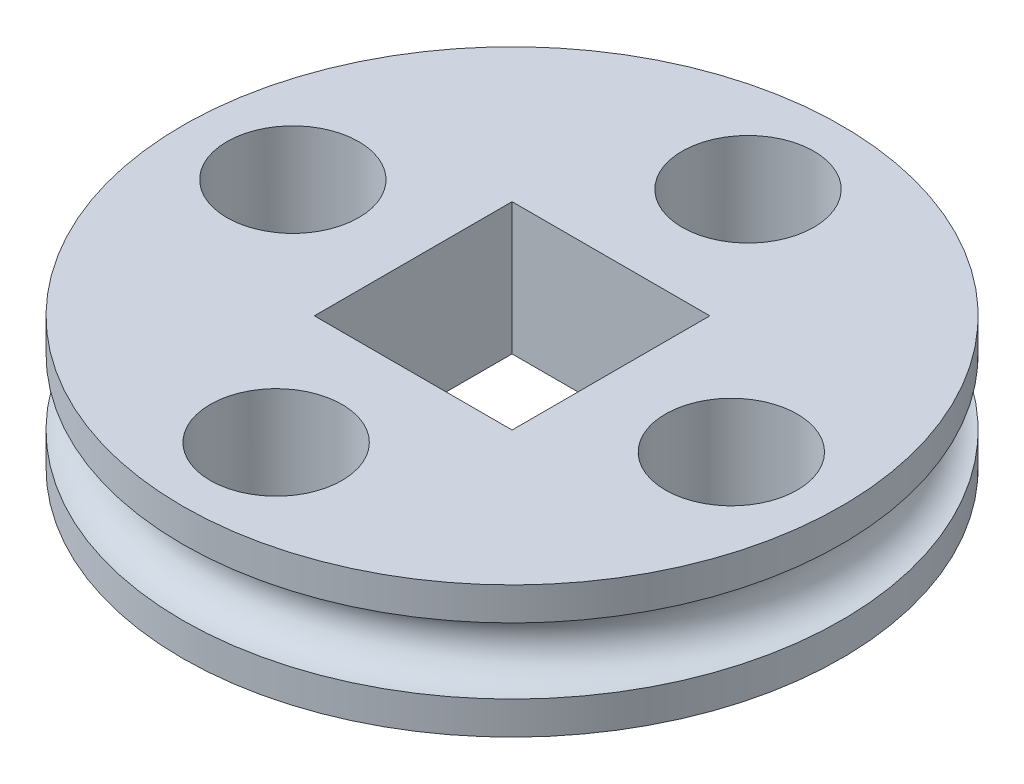
ISO-10303-21;
HEADER;
FILE_DESCRIPTION(('STEP AP214'),'2;1');
FILE_NAME('part.step','',(''),(''),'','','');
FILE_SCHEMA(('AUTOMOTIVE_DESIGN { 1 0 10303 214 1 1 1 1 }'));
ENDSEC;
DATA;
#1=APPLICATION_CONTEXT('core data for automotive mechanical design processes');
#2=APPLICATION_PROTOCOL_DEFINITION('international standard','automotive_design',2000,#1);
#3=PRODUCT_CONTEXT('',#1,'mechanical');
#4=PRODUCT('Part','Part','',(#3));
#5=PRODUCT_RELATED_PRODUCT_CATEGORY('part','',(#4));
#6=PRODUCT_DEFINITION_FORMATION('','',#4);
#7=PRODUCT_DEFINITION_CONTEXT('part definition',#1,'design');
#8=PRODUCT_DEFINITION('design','',#6,#7);
#9=PRODUCT_DEFINITION_SHAPE('','',#8);
#10=(LENGTH_UNIT() NAMED_UNIT(*) SI_UNIT(.MILLI.,.METRE.));
#11=(NAMED_UNIT(*) PLANE_ANGLE_UNIT() SI_UNIT($,.RADIAN.));
#12=(NAMED_UNIT(*) SI_UNIT($,.STERADIAN.) SOLID_ANGLE_UNIT());
#13=UNCERTAINTY_MEASURE_WITH_UNIT(LENGTH_MEASURE(1.E-05),#10,'distance_accuracy_value','');
#14=(GEOMETRIC_REPRESENTATION_CONTEXT(3) GLOBAL_UNCERTAINTY_ASSIGNED_CONTEXT((#13)) GLOBAL_UNIT_ASSIGNED_CONTEXT((#10,
#11,#12)) REPRESENTATION_CONTEXT('',''));
#15=CARTESIAN_POINT('',(0.,0.,0.));
#16=DIRECTION('',(0.,0.,1.));
#17=DIRECTION('',(1.,0.,0.));
#18=AXIS2_PLACEMENT_3D('',#15,#16,#17);
#19=CARTESIAN_POINT('',(0.,2.,0.));
#20=DIRECTION('',(0.,-1.,0.));
#21=DIRECTION('',(0.,0.,-1.));
#22=AXIS2_PLACEMENT_3D('',#19,#20,#21);
#23=CYLINDRICAL_SURFACE('',#22,5.);
#24=CARTESIAN_POINT('',(0.,1.5,0.));
#25=DIRECTION('',(0.,1.,0.));
#26=DIRECTION('',(0.,0.,1.));
#27=AXIS2_PLACEMENT_3D('',#24,#25,#26);
#28=CIRCLE('',#27,5.);
#29=CARTESIAN_POINT('',(0.,1.5,5.));
#30=VERTEX_POINT('',#29);
#31=EDGE_CURVE('E178',#30,#30,#28,.T.);
#32=ORIENTED_EDGE('',*,*,#31,.T.);
#33=EDGE_LOOP('',(#32));
#34=FACE_BOUND('',#33,.T.);
#35=CARTESIAN_POINT('',(0.,2.,0.));
#36=DIRECTION('',(0.,1.,0.));
#37=DIRECTION('',(0.,0.,1.));
#38=AXIS2_PLACEMENT_3D('',#35,#36,#37);
#39=CIRCLE('',#38,5.);
#40=CARTESIAN_POINT('',(0.,2.,5.));
#41=VERTEX_POINT('',#40);
#42=EDGE_CURVE('E123',#41,#41,#39,.T.);
#43=ORIENTED_EDGE('',*,*,#42,.F.);
#44=EDGE_LOOP('',(#43));
#45=FACE_BOUND('',#44,.T.);
#46=ADVANCED_FACE('F43',(#34,#45),#23,.T.);
#47=CARTESIAN_POINT('',(0.,0.5,0.));
#48=DIRECTION('',(0.,1.,0.));
#49=DIRECTION('',(0.,0.,1.));
#50=AXIS2_PLACEMENT_3D('',#47,#48,#49);
#51=CIRCLE('',#50,5.);
#52=CARTESIAN_POINT('',(0.,0.5,5.));
#53=VERTEX_POINT('',#52);
#54=EDGE_CURVE('E168',#53,#53,#51,.T.);
#55=ORIENTED_EDGE('',*,*,#54,.F.);
#56=EDGE_LOOP('',(#55));
#57=FACE_BOUND('',#56,.T.);
#58=CARTESIAN_POINT('',(0.,0.,0.));
#59=DIRECTION('',(0.,1.,0.));
#60=DIRECTION('',(0.,0.,1.));
#61=AXIS2_PLACEMENT_3D('',#58,#59,#60);
#62=CIRCLE('',#61,5.);
#63=CARTESIAN_POINT('',(0.,0.,5.));
#64=VERTEX_POINT('',#63);
#65=EDGE_CURVE('E118',#64,#64,#62,.T.);
#66=ORIENTED_EDGE('',*,*,#65,.T.);
#67=EDGE_LOOP('',(#66));
#68=FACE_BOUND('',#67,.T.);
#69=ADVANCED_FACE('F45',(#57,#68),#23,.T.);
#70=CARTESIAN_POINT('',(0.,2.,0.));
#71=DIRECTION('',(0.,1.,0.));
#72=DIRECTION('',(0.,0.,1.));
#73=AXIS2_PLACEMENT_3D('',#70,#71,#72);
#74=PLANE('',#73);
#75=CARTESIAN_POINT('',(-0.126446107978862,2.,3.45280992710836));
#76=DIRECTION('',(0.,1.,0.));
#77=DIRECTION('',(-1.,0.,0.));
#78=AXIS2_PLACEMENT_3D('',#75,#76,#77);
#79=CIRCLE('',#78,1.);
#80=CARTESIAN_POINT('',(-1.12644610797886,2.,3.45280992710836));
#81=VERTEX_POINT('',#80);
#82=EDGE_CURVE('E147',#81,#81,#79,.T.);
#83=ORIENTED_EDGE('',*,*,#82,.F.);
#84=EDGE_LOOP('',(#83));
#85=FACE_BOUND('',#84,.T.);
#86=CARTESIAN_POINT('',(-3.45280992710836,2.,-0.12644610797885));
#87=DIRECTION('',(0.,1.,0.));
#88=DIRECTION('',(0.,0.,-1.));
#89=AXIS2_PLACEMENT_3D('',#86,#87,#88);
#90=CIRCLE('',#89,1.);
#91=CARTESIAN_POINT('',(-3.45280992710836,2.,-1.12644610797885));
#92=VERTEX_POINT('',#91);
#93=EDGE_CURVE('E167',#92,#92,#90,.T.);
#94=ORIENTED_EDGE('',*,*,#93,.F.);
#95=EDGE_LOOP('',(#94));
#96=FACE_BOUND('',#95,.T.);
#97=CARTESIAN_POINT('',(0.126446107978887,2.,-3.45280992710836));
#98=DIRECTION('',(0.,1.,0.));
#99=DIRECTION('',(1.,0.,0.));
#100=AXIS2_PLACEMENT_3D('',#97,#98,#99);
#101=CIRCLE('',#100,1.);
#102=CARTESIAN_POINT('',(1.12644610797889,2.,-3.45280992710835));
#103=VERTEX_POINT('',#102);
#104=EDGE_CURVE('E162',#103,#103,#101,.T.);
#105=ORIENTED_EDGE('',*,*,#104,.F.);
#106=EDGE_LOOP('',(#105));
#107=FACE_BOUND('',#106,.T.);
#108=CARTESIAN_POINT('',(3.45280992710836,2.,0.12644610797885));
#109=DIRECTION('',(0.,1.,0.));
#110=DIRECTION('',(0.,0.,1.));
#111=AXIS2_PLACEMENT_3D('',#108,#109,#110);
#112=CIRCLE('',#111,1.);
#113=CARTESIAN_POINT('',(3.45280992710836,2.,1.12644610797885));
#114=VERTEX_POINT('',#113);
#115=EDGE_CURVE('E142',#114,#114,#112,.T.);
#116=ORIENTED_EDGE('',*,*,#115,.F.);
#117=EDGE_LOOP('',(#116));
#118=FACE_BOUND('',#117,.T.);
#119=DIRECTION('',(0.,0.,-1.));
#120=VECTOR('',#119,1.);
#121=CARTESIAN_POINT('',(1.5,2.,-1.5));
#122=LINE('',#121,#120);
#123=CARTESIAN_POINT('',(1.5,2.,1.5));
#124=VERTEX_POINT('',#123);
#125=CARTESIAN_POINT('',(1.5,2.,-1.5));
#126=VERTEX_POINT('',#125);
#127=EDGE_CURVE('E61',#124,#126,#122,.T.);
#128=ORIENTED_EDGE('',*,*,#127,.F.);
#129=DIRECTION('',(1.,0.,0.));
#130=VECTOR('',#129,1.);
#131=CARTESIAN_POINT('',(1.5,2.,1.5));
#132=LINE('',#131,#130);
#133=CARTESIAN_POINT('',(-1.5,2.,1.5));
#134=VERTEX_POINT('',#133);
#135=EDGE_CURVE('E108',#134,#124,#132,.T.);
#136=ORIENTED_EDGE('',*,*,#135,.F.);
#137=DIRECTION('',(0.,0.,1.));
#138=VECTOR('',#137,1.);
#139=CARTESIAN_POINT('',(-1.5,2.,-1.5));
#140=LINE('',#139,#138);
#141=CARTESIAN_POINT('',(-1.5,2.,-1.5));
#142=VERTEX_POINT('',#141);
#143=EDGE_CURVE('E90',#142,#134,#140,.T.);
#144=ORIENTED_EDGE('',*,*,#143,.F.);
#145=DIRECTION('',(-1.,0.,0.));
#146=VECTOR('',#145,1.);
#147=CARTESIAN_POINT('',(1.5,2.,-1.5));
#148=LINE('',#147,#146);
#149=EDGE_CURVE('E100',#126,#142,#148,.T.);
#150=ORIENTED_EDGE('',*,*,#149,.F.);
#151=EDGE_LOOP('',(#128,#136,#144,#150));
#152=FACE_BOUND('',#151,.T.);
#153=ORIENTED_EDGE('',*,*,#42,.T.);
#154=EDGE_LOOP('',(#153));
#155=FACE_BOUND('',#154,.T.);
#156=ADVANCED_FACE('F105',(#85,#96,#107,#118,#152,#155),#74,.T.);
#157=CARTESIAN_POINT('',(0.,0.,0.));
#158=DIRECTION('',(0.,1.,0.));
#159=DIRECTION('',(0.,0.,1.));
#160=AXIS2_PLACEMENT_3D('',#157,#158,#159);
#161=PLANE('',#160);
#162=CARTESIAN_POINT('',(-0.126446107978862,0.,3.45280992710836));
#163=DIRECTION('',(0.,1.,0.));
#164=DIRECTION('',(0.,0.,1.));
#165=AXIS2_PLACEMENT_3D('',#162,#163,#164);
#166=CIRCLE('',#165,1.);
#167=CARTESIAN_POINT('',(-0.126446107978862,0.,4.45280992710836));
#168=VERTEX_POINT('',#167);
#169=EDGE_CURVE('E47',#168,#168,#166,.T.);
#170=ORIENTED_EDGE('',*,*,#169,.T.);
#171=EDGE_LOOP('',(#170));
#172=FACE_BOUND('',#171,.T.);
#173=CARTESIAN_POINT('',(-3.45280992710836,0.,-0.12644610797885));
#174=DIRECTION('',(0.,1.,0.));
#175=DIRECTION('',(0.,0.,1.));
#176=AXIS2_PLACEMENT_3D('',#173,#174,#175);
#177=CIRCLE('',#176,1.);
#178=CARTESIAN_POINT('',(-3.45280992710836,0.,0.873553892021149));
#179=VERTEX_POINT('',#178);
#180=EDGE_CURVE('E146',#179,#179,#177,.T.);
#181=ORIENTED_EDGE('',*,*,#180,.T.);
#182=EDGE_LOOP('',(#181));
#183=FACE_BOUND('',#182,.T.);
#184=CARTESIAN_POINT('',(0.126446107978887,0.,-3.45280992710836));
#185=DIRECTION('',(0.,1.,0.));
#186=DIRECTION('',(0.,0.,1.));
#187=AXIS2_PLACEMENT_3D('',#184,#185,#186);
#188=CIRCLE('',#187,1.);
#189=CARTESIAN_POINT('',(0.126446107978887,0.,-2.45280992710836));
#190=VERTEX_POINT('',#189);
#191=EDGE_CURVE('E143',#190,#190,#188,.T.);
#192=ORIENTED_EDGE('',*,*,#191,.T.);
#193=EDGE_LOOP('',(#192));
#194=FACE_BOUND('',#193,.T.);
#195=CARTESIAN_POINT('',(3.45280992710836,0.,0.12644610797885));
#196=DIRECTION('',(0.,1.,0.));
#197=DIRECTION('',(0.,0.,1.));
#198=AXIS2_PLACEMENT_3D('',#195,#196,#197);
#199=CIRCLE('',#198,1.);
#200=CARTESIAN_POINT('',(3.45280992710836,0.,1.12644610797885));
#201=VERTEX_POINT('',#200);
#202=EDGE_CURVE('E138',#201,#201,#199,.T.);
#203=ORIENTED_EDGE('',*,*,#202,.T.);
#204=EDGE_LOOP('',(#203));
#205=FACE_BOUND('',#204,.T.);
#206=DIRECTION('',(1.,0.,0.));
#207=VECTOR('',#206,1.);
#208=CARTESIAN_POINT('',(0.,0.,1.5));
#209=LINE('',#208,#207);
#210=CARTESIAN_POINT('',(-1.5,0.,1.5));
#211=VERTEX_POINT('',#210);
#212=CARTESIAN_POINT('',(1.5,0.,1.5));
#213=VERTEX_POINT('',#212);
#214=EDGE_CURVE('E53',#211,#213,#209,.T.);
#215=ORIENTED_EDGE('',*,*,#214,.T.);
#216=DIRECTION('',(0.,0.,-1.));
#217=VECTOR('',#216,1.);
#218=CARTESIAN_POINT('',(1.5,0.,0.));
#219=LINE('',#218,#217);
#220=CARTESIAN_POINT('',(1.5,0.,-1.5));
#221=VERTEX_POINT('',#220);
#222=EDGE_CURVE('E11',#213,#221,#219,.T.);
#223=ORIENTED_EDGE('',*,*,#222,.T.);
#224=DIRECTION('',(-1.,0.,0.));
#225=VECTOR('',#224,1.);
#226=CARTESIAN_POINT('',(0.,0.,-1.5));
#227=LINE('',#226,#225);
#228=CARTESIAN_POINT('',(-1.5,0.,-1.5));
#229=VERTEX_POINT('',#228);
#230=EDGE_CURVE('E127',#221,#229,#227,.T.);
#231=ORIENTED_EDGE('',*,*,#230,.T.);
#232=DIRECTION('',(0.,0.,1.));
#233=VECTOR('',#232,1.);
#234=CARTESIAN_POINT('',(-1.5,0.,0.));
#235=LINE('',#234,#233);
#236=EDGE_CURVE('E93',#229,#211,#235,.T.);
#237=ORIENTED_EDGE('',*,*,#236,.T.);
#238=EDGE_LOOP('',(#215,#223,#231,#237));
#239=FACE_BOUND('',#238,.T.);
#240=ORIENTED_EDGE('',*,*,#65,.F.);
#241=EDGE_LOOP('',(#240));
#242=FACE_BOUND('',#241,.T.);
#243=ADVANCED_FACE('F196',(#172,#183,#194,#205,#239,#242),#161,.F.);
#244=CARTESIAN_POINT('',(1.5,-1.,-1.5));
#245=DIRECTION('',(1.,0.,0.));
#246=DIRECTION('',(0.,0.,-1.));
#247=AXIS2_PLACEMENT_3D('',#244,#245,#246);
#248=PLANE('',#247);
#249=DIRECTION('',(0.,1.,0.));
#250=VECTOR('',#249,1.);
#251=CARTESIAN_POINT('',(1.5,-1.,1.5));
#252=LINE('',#251,#250);
#253=EDGE_CURVE('E115',#213,#124,#252,.T.);
#254=ORIENTED_EDGE('',*,*,#253,.T.);
#255=ORIENTED_EDGE('',*,*,#127,.T.);
#256=DIRECTION('',(0.,1.,0.));
#257=VECTOR('',#256,1.);
#258=CARTESIAN_POINT('',(1.5,-1.,-1.5));
#259=LINE('',#258,#257);
#260=EDGE_CURVE('E97',#221,#126,#259,.T.);
#261=ORIENTED_EDGE('',*,*,#260,.F.);
#262=ORIENTED_EDGE('',*,*,#222,.F.);
#263=EDGE_LOOP('',(#254,#255,#261,#262));
#264=FACE_BOUND('',#263,.T.);
#265=ADVANCED_FACE('F198',(#264),#248,.F.);
#266=CARTESIAN_POINT('',(1.5,-1.,1.5));
#267=DIRECTION('',(0.,0.,1.));
#268=DIRECTION('',(1.,0.,0.));
#269=AXIS2_PLACEMENT_3D('',#266,#267,#268);
#270=PLANE('',#269);
#271=DIRECTION('',(0.,1.,0.));
#272=VECTOR('',#271,1.);
#273=CARTESIAN_POINT('',(-1.5,-1.,1.5));
#274=LINE('',#273,#272);
#275=EDGE_CURVE('E96',#211,#134,#274,.T.);
#276=ORIENTED_EDGE('',*,*,#275,.T.);
#277=ORIENTED_EDGE('',*,*,#135,.T.);
#278=ORIENTED_EDGE('',*,*,#253,.F.);
#279=ORIENTED_EDGE('',*,*,#214,.F.);
#280=EDGE_LOOP('',(#276,#277,#278,#279));
#281=FACE_BOUND('',#280,.T.);
#282=ADVANCED_FACE('F203',(#281),#270,.F.);
#283=CARTESIAN_POINT('',(-1.5,-1.,-1.5));
#284=DIRECTION('',(-1.,0.,0.));
#285=DIRECTION('',(0.,0.,1.));
#286=AXIS2_PLACEMENT_3D('',#283,#284,#285);
#287=PLANE('',#286);
#288=DIRECTION('',(0.,1.,0.));
#289=VECTOR('',#288,1.);
#290=CARTESIAN_POINT('',(-1.5,-1.,-1.5));
#291=LINE('',#290,#289);
#292=EDGE_CURVE('E69',#229,#142,#291,.T.);
#293=ORIENTED_EDGE('',*,*,#292,.T.);
#294=ORIENTED_EDGE('',*,*,#143,.T.);
#295=ORIENTED_EDGE('',*,*,#275,.F.);
#296=ORIENTED_EDGE('',*,*,#236,.F.);
#297=EDGE_LOOP('',(#293,#294,#295,#296));
#298=FACE_BOUND('',#297,.T.);
#299=ADVANCED_FACE('F87',(#298),#287,.F.);
#300=CARTESIAN_POINT('',(1.5,-1.,-1.5));
#301=DIRECTION('',(0.,0.,-1.));
#302=DIRECTION('',(-1.,0.,0.));
#303=AXIS2_PLACEMENT_3D('',#300,#301,#302);
#304=PLANE('',#303);
#305=ORIENTED_EDGE('',*,*,#260,.T.);
#306=ORIENTED_EDGE('',*,*,#149,.T.);
#307=ORIENTED_EDGE('',*,*,#292,.F.);
#308=ORIENTED_EDGE('',*,*,#230,.F.);
#309=EDGE_LOOP('',(#305,#306,#307,#308));
#310=FACE_BOUND('',#309,.T.);
#311=ADVANCED_FACE('F101',(#310),#304,.F.);
#312=CARTESIAN_POINT('',(3.45280992710836,-1.,0.12644610797885));
#313=DIRECTION('',(0.,1.,0.));
#314=DIRECTION('',(0.,0.,1.));
#315=AXIS2_PLACEMENT_3D('',#312,#313,#314);
#316=CYLINDRICAL_SURFACE('',#315,1.);
#317=ORIENTED_EDGE('',*,*,#115,.T.);
#318=EDGE_LOOP('',(#317));
#319=FACE_BOUND('',#318,.T.);
#320=ORIENTED_EDGE('',*,*,#202,.F.);
#321=EDGE_LOOP('',(#320));
#322=FACE_BOUND('',#321,.T.);
#323=ADVANCED_FACE('F226',(#319,#322),#316,.F.);
#324=CARTESIAN_POINT('',(0.126446107978887,-1.,-3.45280992710836));
#325=DIRECTION('',(0.,1.,0.));
#326=DIRECTION('',(0.,0.,1.));
#327=AXIS2_PLACEMENT_3D('',#324,#325,#326);
#328=CYLINDRICAL_SURFACE('',#327,1.);
#329=ORIENTED_EDGE('',*,*,#104,.T.);
#330=EDGE_LOOP('',(#329));
#331=FACE_BOUND('',#330,.T.);
#332=ORIENTED_EDGE('',*,*,#191,.F.);
#333=EDGE_LOOP('',(#332));
#334=FACE_BOUND('',#333,.T.);
#335=ADVANCED_FACE('F236',(#331,#334),#328,.F.);
#336=CARTESIAN_POINT('',(-3.45280992710836,-1.,-0.12644610797885));
#337=DIRECTION('',(0.,1.,0.));
#338=DIRECTION('',(0.,0.,1.));
#339=AXIS2_PLACEMENT_3D('',#336,#337,#338);
#340=CYLINDRICAL_SURFACE('',#339,1.);
#341=ORIENTED_EDGE('',*,*,#93,.T.);
#342=EDGE_LOOP('',(#341));
#343=FACE_BOUND('',#342,.T.);
#344=ORIENTED_EDGE('',*,*,#180,.F.);
#345=EDGE_LOOP('',(#344));
#346=FACE_BOUND('',#345,.T.);
#347=ADVANCED_FACE('F241',(#343,#346),#340,.F.);
#348=CARTESIAN_POINT('',(-0.126446107978862,-1.,3.45280992710836));
#349=DIRECTION('',(0.,1.,0.));
#350=DIRECTION('',(0.,0.,1.));
#351=AXIS2_PLACEMENT_3D('',#348,#349,#350);
#352=CYLINDRICAL_SURFACE('',#351,1.);
#353=ORIENTED_EDGE('',*,*,#82,.T.);
#354=EDGE_LOOP('',(#353));
#355=FACE_BOUND('',#354,.T.);
#356=ORIENTED_EDGE('',*,*,#169,.F.);
#357=EDGE_LOOP('',(#356));
#358=FACE_BOUND('',#357,.T.);
#359=ADVANCED_FACE('F188',(#355,#358),#352,.F.);
#360=CARTESIAN_POINT('',(0.,1.,0.));
#361=DIRECTION('',(0.,1.,0.));
#362=DIRECTION('',(0.,0.,1.));
#363=AXIS2_PLACEMENT_3D('',#360,#361,#362);
#364=TOROIDAL_SURFACE('',#363,5.,0.5);
#365=ORIENTED_EDGE('',*,*,#31,.F.);
#366=EDGE_LOOP('',(#365));
#367=FACE_BOUND('',#366,.T.);
#368=ORIENTED_EDGE('',*,*,#54,.T.);
#369=EDGE_LOOP('',(#368));
#370=FACE_BOUND('',#369,.T.);
#371=ADVANCED_FACE('F185',(#367,#370),#364,.F.);
#372=CLOSED_SHELL('',(#46,#69,#156,#243,#265,#282,#299,#311,#323,#335,#347,#359,#371));
#373=MANIFOLD_SOLID_BREP('B2',#372);
#374=ADVANCED_BREP_SHAPE_REPRESENTATION('',(#18,#373),#14);
#375=SHAPE_DEFINITION_REPRESENTATION(#9,#374);
ENDSEC;
END-ISO-10303-21;
